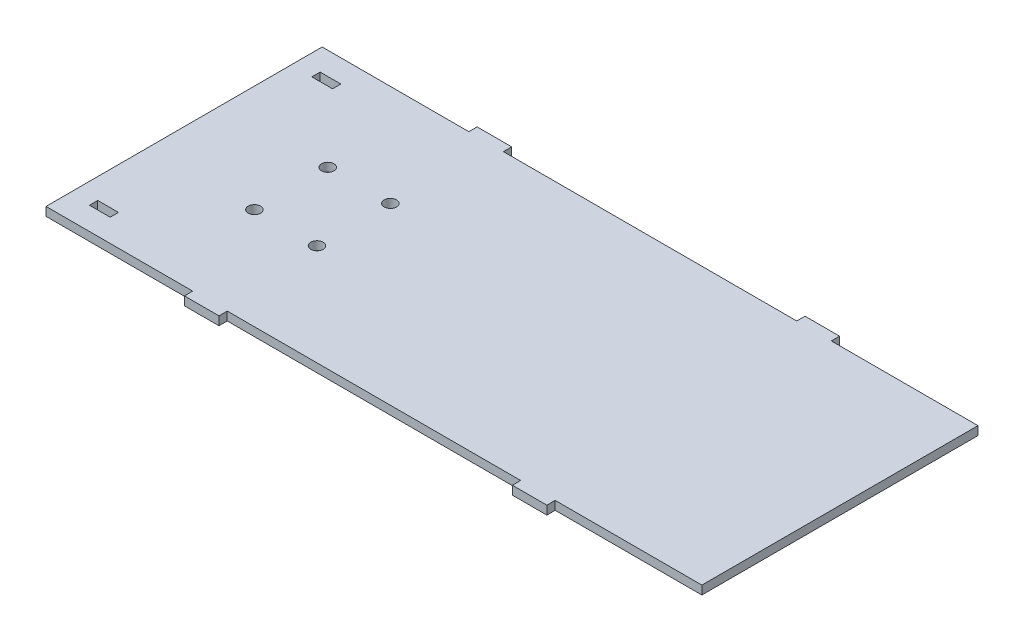
ISO-10303-21;
HEADER;
FILE_DESCRIPTION(('STEP AP214'),'2;1');
FILE_NAME('part.step','',(''),(''),'','','');
FILE_SCHEMA(('AUTOMOTIVE_DESIGN { 1 0 10303 214 1 1 1 1 }'));
ENDSEC;
DATA;
#1=APPLICATION_CONTEXT('core data for automotive mechanical design processes');
#2=APPLICATION_PROTOCOL_DEFINITION('international standard','automotive_design',2000,#1);
#3=PRODUCT_CONTEXT('',#1,'mechanical');
#4=PRODUCT('Part','Part','',(#3));
#5=PRODUCT_RELATED_PRODUCT_CATEGORY('part','',(#4));
#6=PRODUCT_DEFINITION_FORMATION('','',#4);
#7=PRODUCT_DEFINITION_CONTEXT('part definition',#1,'design');
#8=PRODUCT_DEFINITION('design','',#6,#7);
#9=PRODUCT_DEFINITION_SHAPE('','',#8);
#10=(LENGTH_UNIT() NAMED_UNIT(*) SI_UNIT(.MILLI.,.METRE.));
#11=(NAMED_UNIT(*) PLANE_ANGLE_UNIT() SI_UNIT($,.RADIAN.));
#12=(NAMED_UNIT(*) SI_UNIT($,.STERADIAN.) SOLID_ANGLE_UNIT());
#13=UNCERTAINTY_MEASURE_WITH_UNIT(LENGTH_MEASURE(1.E-05),#10,'distance_accuracy_value','');
#14=(GEOMETRIC_REPRESENTATION_CONTEXT(3) GLOBAL_UNCERTAINTY_ASSIGNED_CONTEXT((#13)) GLOBAL_UNIT_ASSIGNED_CONTEXT((#10,
#11,#12)) REPRESENTATION_CONTEXT('',''));
#15=CARTESIAN_POINT('',(0.,0.,0.));
#16=DIRECTION('',(0.,0.,1.));
#17=DIRECTION('',(1.,0.,0.));
#18=AXIS2_PLACEMENT_3D('',#15,#16,#17);
#19=CARTESIAN_POINT('',(0.,3.175,0.));
#20=DIRECTION('',(0.,0.,-1.));
#21=DIRECTION('',(-1.,0.,0.));
#22=AXIS2_PLACEMENT_3D('',#19,#20,#21);
#23=PLANE('',#22);
#24=DIRECTION('',(1.,0.,0.));
#25=VECTOR('',#24,1.);
#26=CARTESIAN_POINT('',(0.,0.,0.));
#27=LINE('',#26,#25);
#28=CARTESIAN_POINT('',(-12.7,0.,0.));
#29=VERTEX_POINT('',#28);
#30=CARTESIAN_POINT('',(41.2749999999999,0.,0.));
#31=VERTEX_POINT('',#30);
#32=EDGE_CURVE('E346',#29,#31,#27,.T.);
#33=ORIENTED_EDGE('',*,*,#32,.T.);
#34=DIRECTION('',(0.,-1.,0.));
#35=VECTOR('',#34,1.);
#36=CARTESIAN_POINT('',(41.2749999999999,3.175,0.));
#37=LINE('',#36,#35);
#38=CARTESIAN_POINT('',(41.2749999999999,3.175,0.));
#39=VERTEX_POINT('',#38);
#40=EDGE_CURVE('E11',#39,#31,#37,.T.);
#41=ORIENTED_EDGE('',*,*,#40,.F.);
#42=DIRECTION('',(1.,0.,0.));
#43=VECTOR('',#42,1.);
#44=CARTESIAN_POINT('',(0.,3.175,0.));
#45=LINE('',#44,#43);
#46=CARTESIAN_POINT('',(-12.7,3.175,0.));
#47=VERTEX_POINT('',#46);
#48=EDGE_CURVE('E350',#47,#39,#45,.T.);
#49=ORIENTED_EDGE('',*,*,#48,.F.);
#50=DIRECTION('',(0.,-1.,0.));
#51=VECTOR('',#50,1.);
#52=CARTESIAN_POINT('',(-12.7,3.175,0.));
#53=LINE('',#52,#51);
#54=EDGE_CURVE('E411',#47,#29,#53,.T.);
#55=ORIENTED_EDGE('',*,*,#54,.T.);
#56=EDGE_LOOP('',(#33,#41,#49,#55));
#57=FACE_BOUND('',#56,.T.);
#58=ADVANCED_FACE('F39',(#57),#23,.F.);
#59=CARTESIAN_POINT('',(41.2749999999999,3.175,0.));
#60=DIRECTION('',(1.,0.,0.));
#61=DIRECTION('',(0.,0.,-1.));
#62=AXIS2_PLACEMENT_3D('',#59,#60,#61);
#63=PLANE('',#62);
#64=DIRECTION('',(0.,0.,1.));
#65=VECTOR('',#64,1.);
#66=CARTESIAN_POINT('',(41.2749999999999,0.,0.));
#67=LINE('',#66,#65);
#68=CARTESIAN_POINT('',(41.2749999999999,0.,3.04799999999991));
#69=VERTEX_POINT('',#68);
#70=EDGE_CURVE('E414',#31,#69,#67,.T.);
#71=ORIENTED_EDGE('',*,*,#70,.T.);
#72=DIRECTION('',(0.,-1.,0.));
#73=VECTOR('',#72,1.);
#74=CARTESIAN_POINT('',(41.2749999999999,3.175,3.04799999999991));
#75=LINE('',#74,#73);
#76=CARTESIAN_POINT('',(41.2749999999999,3.175,3.04799999999991));
#77=VERTEX_POINT('',#76);
#78=EDGE_CURVE('E47',#77,#69,#75,.T.);
#79=ORIENTED_EDGE('',*,*,#78,.F.);
#80=DIRECTION('',(0.,0.,1.));
#81=VECTOR('',#80,1.);
#82=CARTESIAN_POINT('',(41.2749999999999,3.175,0.));
#83=LINE('',#82,#81);
#84=EDGE_CURVE('E353',#39,#77,#83,.T.);
#85=ORIENTED_EDGE('',*,*,#84,.F.);
#86=ORIENTED_EDGE('',*,*,#40,.T.);
#87=EDGE_LOOP('',(#71,#79,#85,#86));
#88=FACE_BOUND('',#87,.T.);
#89=ADVANCED_FACE('F571',(#88),#63,.F.);
#90=CARTESIAN_POINT('',(53.975,3.175,3.04799999999991));
#91=DIRECTION('',(0.,0.,-1.));
#92=DIRECTION('',(-1.,0.,0.));
#93=AXIS2_PLACEMENT_3D('',#90,#91,#92);
#94=PLANE('',#93);
#95=DIRECTION('',(1.,0.,0.));
#96=VECTOR('',#95,1.);
#97=CARTESIAN_POINT('',(53.975,0.,3.04799999999991));
#98=LINE('',#97,#96);
#99=CARTESIAN_POINT('',(53.975,0.,3.04799999999991));
#100=VERTEX_POINT('',#99);
#101=EDGE_CURVE('E417',#69,#100,#98,.T.);
#102=ORIENTED_EDGE('',*,*,#101,.T.);
#103=DIRECTION('',(0.,-1.,0.));
#104=VECTOR('',#103,1.);
#105=CARTESIAN_POINT('',(53.975,3.175,3.04799999999991));
#106=LINE('',#105,#104);
#107=CARTESIAN_POINT('',(53.975,3.175,3.04799999999991));
#108=VERTEX_POINT('',#107);
#109=EDGE_CURVE('E539',#108,#100,#106,.T.);
#110=ORIENTED_EDGE('',*,*,#109,.F.);
#111=DIRECTION('',(1.,0.,0.));
#112=VECTOR('',#111,1.);
#113=CARTESIAN_POINT('',(53.975,3.175,3.04799999999991));
#114=LINE('',#113,#112);
#115=EDGE_CURVE('E357',#77,#108,#114,.T.);
#116=ORIENTED_EDGE('',*,*,#115,.F.);
#117=ORIENTED_EDGE('',*,*,#78,.T.);
#118=EDGE_LOOP('',(#102,#110,#116,#117));
#119=FACE_BOUND('',#118,.T.);
#120=ADVANCED_FACE('F548',(#119),#94,.F.);
#121=CARTESIAN_POINT('',(53.9749999999999,3.175,0.));
#122=DIRECTION('',(-1.,0.,0.));
#123=DIRECTION('',(0.,0.,1.));
#124=AXIS2_PLACEMENT_3D('',#121,#122,#123);
#125=PLANE('',#124);
#126=DIRECTION('',(0.,0.,-1.));
#127=VECTOR('',#126,1.);
#128=CARTESIAN_POINT('',(53.9749999999999,0.,0.));
#129=LINE('',#128,#127);
#130=CARTESIAN_POINT('',(53.9749999999999,0.,0.));
#131=VERTEX_POINT('',#130);
#132=EDGE_CURVE('E420',#100,#131,#129,.T.);
#133=ORIENTED_EDGE('',*,*,#132,.T.);
#134=DIRECTION('',(0.,-1.,0.));
#135=VECTOR('',#134,1.);
#136=CARTESIAN_POINT('',(53.9749999999999,3.175,0.));
#137=LINE('',#136,#135);
#138=CARTESIAN_POINT('',(53.9749999999999,3.175,0.));
#139=VERTEX_POINT('',#138);
#140=EDGE_CURVE('E535',#139,#131,#137,.T.);
#141=ORIENTED_EDGE('',*,*,#140,.F.);
#142=DIRECTION('',(0.,0.,-1.));
#143=VECTOR('',#142,1.);
#144=CARTESIAN_POINT('',(53.9749999999999,3.175,0.));
#145=LINE('',#144,#143);
#146=EDGE_CURVE('E360',#108,#139,#145,.T.);
#147=ORIENTED_EDGE('',*,*,#146,.F.);
#148=ORIENTED_EDGE('',*,*,#109,.T.);
#149=EDGE_LOOP('',(#133,#141,#147,#148));
#150=FACE_BOUND('',#149,.T.);
#151=ADVANCED_FACE('F559',(#150),#125,.F.);
#152=CARTESIAN_POINT('',(53.9749999999999,3.175,0.));
#153=DIRECTION('',(0.,0.,-1.));
#154=DIRECTION('',(-1.,0.,0.));
#155=AXIS2_PLACEMENT_3D('',#152,#153,#154);
#156=PLANE('',#155);
#157=DIRECTION('',(1.,0.,0.));
#158=VECTOR('',#157,1.);
#159=CARTESIAN_POINT('',(53.9749999999999,0.,0.));
#160=LINE('',#159,#158);
#161=CARTESIAN_POINT('',(161.925,0.,0.));
#162=VERTEX_POINT('',#161);
#163=EDGE_CURVE('E423',#131,#162,#160,.T.);
#164=ORIENTED_EDGE('',*,*,#163,.T.);
#165=DIRECTION('',(0.,-1.,0.));
#166=VECTOR('',#165,1.);
#167=CARTESIAN_POINT('',(161.925,3.175,0.));
#168=LINE('',#167,#166);
#169=CARTESIAN_POINT('',(161.925,3.175,0.));
#170=VERTEX_POINT('',#169);
#171=EDGE_CURVE('E531',#170,#162,#168,.T.);
#172=ORIENTED_EDGE('',*,*,#171,.F.);
#173=DIRECTION('',(1.,0.,0.));
#174=VECTOR('',#173,1.);
#175=CARTESIAN_POINT('',(53.9749999999999,3.175,0.));
#176=LINE('',#175,#174);
#177=EDGE_CURVE('E363',#139,#170,#176,.T.);
#178=ORIENTED_EDGE('',*,*,#177,.F.);
#179=ORIENTED_EDGE('',*,*,#140,.T.);
#180=EDGE_LOOP('',(#164,#172,#178,#179));
#181=FACE_BOUND('',#180,.T.);
#182=ADVANCED_FACE('F563',(#181),#156,.F.);
#183=CARTESIAN_POINT('',(161.925,3.175,0.));
#184=DIRECTION('',(1.,0.,0.));
#185=DIRECTION('',(0.,0.,-1.));
#186=AXIS2_PLACEMENT_3D('',#183,#184,#185);
#187=PLANE('',#186);
#188=DIRECTION('',(0.,0.,1.));
#189=VECTOR('',#188,1.);
#190=CARTESIAN_POINT('',(161.925,0.,0.));
#191=LINE('',#190,#189);
#192=CARTESIAN_POINT('',(161.925,0.,3.048));
#193=VERTEX_POINT('',#192);
#194=EDGE_CURVE('E426',#162,#193,#191,.T.);
#195=ORIENTED_EDGE('',*,*,#194,.T.);
#196=DIRECTION('',(0.,-1.,0.));
#197=VECTOR('',#196,1.);
#198=CARTESIAN_POINT('',(161.925,3.175,3.048));
#199=LINE('',#198,#197);
#200=CARTESIAN_POINT('',(161.925,3.175,3.048));
#201=VERTEX_POINT('',#200);
#202=EDGE_CURVE('E527',#201,#193,#199,.T.);
#203=ORIENTED_EDGE('',*,*,#202,.F.);
#204=DIRECTION('',(0.,0.,1.));
#205=VECTOR('',#204,1.);
#206=CARTESIAN_POINT('',(161.925,3.175,0.));
#207=LINE('',#206,#205);
#208=EDGE_CURVE('E366',#170,#201,#207,.T.);
#209=ORIENTED_EDGE('',*,*,#208,.F.);
#210=ORIENTED_EDGE('',*,*,#171,.T.);
#211=EDGE_LOOP('',(#195,#203,#209,#210));
#212=FACE_BOUND('',#211,.T.);
#213=ADVANCED_FACE('F643',(#212),#187,.F.);
#214=CARTESIAN_POINT('',(161.925,3.175,3.048));
#215=DIRECTION('',(0.,0.,-1.));
#216=DIRECTION('',(-1.,0.,0.));
#217=AXIS2_PLACEMENT_3D('',#214,#215,#216);
#218=PLANE('',#217);
#219=DIRECTION('',(1.,0.,0.));
#220=VECTOR('',#219,1.);
#221=CARTESIAN_POINT('',(161.925,0.,3.048));
#222=LINE('',#221,#220);
#223=CARTESIAN_POINT('',(174.625,0.,3.048));
#224=VERTEX_POINT('',#223);
#225=EDGE_CURVE('E429',#193,#224,#222,.T.);
#226=ORIENTED_EDGE('',*,*,#225,.T.);
#227=DIRECTION('',(0.,-1.,0.));
#228=VECTOR('',#227,1.);
#229=CARTESIAN_POINT('',(174.625,3.175,3.048));
#230=LINE('',#229,#228);
#231=CARTESIAN_POINT('',(174.625,3.175,3.048));
#232=VERTEX_POINT('',#231);
#233=EDGE_CURVE('E523',#232,#224,#230,.T.);
#234=ORIENTED_EDGE('',*,*,#233,.F.);
#235=DIRECTION('',(1.,0.,0.));
#236=VECTOR('',#235,1.);
#237=CARTESIAN_POINT('',(161.925,3.175,3.048));
#238=LINE('',#237,#236);
#239=EDGE_CURVE('E369',#201,#232,#238,.T.);
#240=ORIENTED_EDGE('',*,*,#239,.F.);
#241=ORIENTED_EDGE('',*,*,#202,.T.);
#242=EDGE_LOOP('',(#226,#234,#240,#241));
#243=FACE_BOUND('',#242,.T.);
#244=ADVANCED_FACE('F640',(#243),#218,.F.);
#245=CARTESIAN_POINT('',(174.625,3.175,0.));
#246=DIRECTION('',(-1.,0.,0.));
#247=DIRECTION('',(0.,0.,1.));
#248=AXIS2_PLACEMENT_3D('',#245,#246,#247);
#249=PLANE('',#248);
#250=DIRECTION('',(0.,0.,-1.));
#251=VECTOR('',#250,1.);
#252=CARTESIAN_POINT('',(174.625,0.,0.));
#253=LINE('',#252,#251);
#254=CARTESIAN_POINT('',(174.625,0.,0.));
#255=VERTEX_POINT('',#254);
#256=EDGE_CURVE('E432',#224,#255,#253,.T.);
#257=ORIENTED_EDGE('',*,*,#256,.T.);
#258=DIRECTION('',(0.,-1.,0.));
#259=VECTOR('',#258,1.);
#260=CARTESIAN_POINT('',(174.625,3.175,0.));
#261=LINE('',#260,#259);
#262=CARTESIAN_POINT('',(174.625,3.175,0.));
#263=VERTEX_POINT('',#262);
#264=EDGE_CURVE('E519',#263,#255,#261,.T.);
#265=ORIENTED_EDGE('',*,*,#264,.F.);
#266=DIRECTION('',(0.,0.,-1.));
#267=VECTOR('',#266,1.);
#268=CARTESIAN_POINT('',(174.625,3.175,0.));
#269=LINE('',#268,#267);
#270=EDGE_CURVE('E372',#232,#263,#269,.T.);
#271=ORIENTED_EDGE('',*,*,#270,.F.);
#272=ORIENTED_EDGE('',*,*,#233,.T.);
#273=EDGE_LOOP('',(#257,#265,#271,#272));
#274=FACE_BOUND('',#273,.T.);
#275=ADVANCED_FACE('F636',(#274),#249,.F.);
#276=CARTESIAN_POINT('',(174.625,3.175,0.));
#277=DIRECTION('',(0.,0.,-1.));
#278=DIRECTION('',(-1.,0.,0.));
#279=AXIS2_PLACEMENT_3D('',#276,#277,#278);
#280=PLANE('',#279);
#281=DIRECTION('',(1.,0.,0.));
#282=VECTOR('',#281,1.);
#283=CARTESIAN_POINT('',(174.625,0.,0.));
#284=LINE('',#283,#282);
#285=CARTESIAN_POINT('',(228.6,0.,0.));
#286=VERTEX_POINT('',#285);
#287=EDGE_CURVE('E435',#255,#286,#284,.T.);
#288=ORIENTED_EDGE('',*,*,#287,.T.);
#289=DIRECTION('',(0.,-1.,0.));
#290=VECTOR('',#289,1.);
#291=CARTESIAN_POINT('',(228.6,3.175,0.));
#292=LINE('',#291,#290);
#293=CARTESIAN_POINT('',(228.6,3.175,0.));
#294=VERTEX_POINT('',#293);
#295=EDGE_CURVE('E515',#294,#286,#292,.T.);
#296=ORIENTED_EDGE('',*,*,#295,.F.);
#297=DIRECTION('',(1.,0.,0.));
#298=VECTOR('',#297,1.);
#299=CARTESIAN_POINT('',(174.625,3.175,0.));
#300=LINE('',#299,#298);
#301=EDGE_CURVE('E375',#263,#294,#300,.T.);
#302=ORIENTED_EDGE('',*,*,#301,.F.);
#303=ORIENTED_EDGE('',*,*,#264,.T.);
#304=EDGE_LOOP('',(#288,#296,#302,#303));
#305=FACE_BOUND('',#304,.T.);
#306=ADVANCED_FACE('F632',(#305),#280,.F.);
#307=CARTESIAN_POINT('',(228.6,3.175,0.));
#308=DIRECTION('',(-1.,0.,0.));
#309=DIRECTION('',(0.,0.,1.));
#310=AXIS2_PLACEMENT_3D('',#307,#308,#309);
#311=PLANE('',#310);
#312=DIRECTION('',(0.,0.,-1.));
#313=VECTOR('',#312,1.);
#314=CARTESIAN_POINT('',(228.6,0.,0.));
#315=LINE('',#314,#313);
#316=CARTESIAN_POINT('',(228.6,0.,-101.6));
#317=VERTEX_POINT('',#316);
#318=EDGE_CURVE('E438',#286,#317,#315,.T.);
#319=ORIENTED_EDGE('',*,*,#318,.T.);
#320=DIRECTION('',(0.,-1.,0.));
#321=VECTOR('',#320,1.);
#322=CARTESIAN_POINT('',(228.6,3.175,-101.6));
#323=LINE('',#322,#321);
#324=CARTESIAN_POINT('',(228.6,3.175,-101.6));
#325=VERTEX_POINT('',#324);
#326=EDGE_CURVE('E511',#325,#317,#323,.T.);
#327=ORIENTED_EDGE('',*,*,#326,.F.);
#328=DIRECTION('',(0.,0.,-1.));
#329=VECTOR('',#328,1.);
#330=CARTESIAN_POINT('',(228.6,3.175,0.));
#331=LINE('',#330,#329);
#332=EDGE_CURVE('E378',#294,#325,#331,.T.);
#333=ORIENTED_EDGE('',*,*,#332,.F.);
#334=ORIENTED_EDGE('',*,*,#295,.T.);
#335=EDGE_LOOP('',(#319,#327,#333,#334));
#336=FACE_BOUND('',#335,.T.);
#337=ADVANCED_FACE('F627',(#336),#311,.F.);
#338=CARTESIAN_POINT('',(174.625,3.175,-101.6));
#339=DIRECTION('',(0.,0.,1.));
#340=DIRECTION('',(1.,0.,0.));
#341=AXIS2_PLACEMENT_3D('',#338,#339,#340);
#342=PLANE('',#341);
#343=DIRECTION('',(-1.,0.,0.));
#344=VECTOR('',#343,1.);
#345=CARTESIAN_POINT('',(174.625,0.,-101.6));
#346=LINE('',#345,#344);
#347=CARTESIAN_POINT('',(174.625,0.,-101.6));
#348=VERTEX_POINT('',#347);
#349=EDGE_CURVE('E441',#317,#348,#346,.T.);
#350=ORIENTED_EDGE('',*,*,#349,.T.);
#351=DIRECTION('',(0.,-1.,0.));
#352=VECTOR('',#351,1.);
#353=CARTESIAN_POINT('',(174.625,3.175,-101.6));
#354=LINE('',#353,#352);
#355=CARTESIAN_POINT('',(174.625,3.175,-101.6));
#356=VERTEX_POINT('',#355);
#357=EDGE_CURVE('E507',#356,#348,#354,.T.);
#358=ORIENTED_EDGE('',*,*,#357,.F.);
#359=DIRECTION('',(-1.,0.,0.));
#360=VECTOR('',#359,1.);
#361=CARTESIAN_POINT('',(174.625,3.175,-101.6));
#362=LINE('',#361,#360);
#363=EDGE_CURVE('E381',#325,#356,#362,.T.);
#364=ORIENTED_EDGE('',*,*,#363,.F.);
#365=ORIENTED_EDGE('',*,*,#326,.T.);
#366=EDGE_LOOP('',(#350,#358,#364,#365));
#367=FACE_BOUND('',#366,.T.);
#368=ADVANCED_FACE('F621',(#367),#342,.F.);
#369=CARTESIAN_POINT('',(174.625,3.175,-101.6));
#370=DIRECTION('',(-1.,0.,0.));
#371=DIRECTION('',(0.,0.,1.));
#372=AXIS2_PLACEMENT_3D('',#369,#370,#371);
#373=PLANE('',#372);
#374=DIRECTION('',(0.,0.,-1.));
#375=VECTOR('',#374,1.);
#376=CARTESIAN_POINT('',(174.625,0.,-101.6));
#377=LINE('',#376,#375);
#378=CARTESIAN_POINT('',(174.625,0.,-104.648));
#379=VERTEX_POINT('',#378);
#380=EDGE_CURVE('E444',#348,#379,#377,.T.);
#381=ORIENTED_EDGE('',*,*,#380,.T.);
#382=DIRECTION('',(0.,-1.,0.));
#383=VECTOR('',#382,1.);
#384=CARTESIAN_POINT('',(174.625,3.175,-104.648));
#385=LINE('',#384,#383);
#386=CARTESIAN_POINT('',(174.625,3.175,-104.648));
#387=VERTEX_POINT('',#386);
#388=EDGE_CURVE('E503',#387,#379,#385,.T.);
#389=ORIENTED_EDGE('',*,*,#388,.F.);
#390=DIRECTION('',(0.,0.,-1.));
#391=VECTOR('',#390,1.);
#392=CARTESIAN_POINT('',(174.625,3.175,-101.6));
#393=LINE('',#392,#391);
#394=EDGE_CURVE('E384',#356,#387,#393,.T.);
#395=ORIENTED_EDGE('',*,*,#394,.F.);
#396=ORIENTED_EDGE('',*,*,#357,.T.);
#397=EDGE_LOOP('',(#381,#389,#395,#396));
#398=FACE_BOUND('',#397,.T.);
#399=ADVANCED_FACE('F617',(#398),#373,.F.);
#400=CARTESIAN_POINT('',(161.925,3.175,-104.648));
#401=DIRECTION('',(0.,0.,1.));
#402=DIRECTION('',(1.,0.,0.));
#403=AXIS2_PLACEMENT_3D('',#400,#401,#402);
#404=PLANE('',#403);
#405=DIRECTION('',(-1.,0.,0.));
#406=VECTOR('',#405,1.);
#407=CARTESIAN_POINT('',(161.925,0.,-104.648));
#408=LINE('',#407,#406);
#409=CARTESIAN_POINT('',(161.925,0.,-104.648));
#410=VERTEX_POINT('',#409);
#411=EDGE_CURVE('E447',#379,#410,#408,.T.);
#412=ORIENTED_EDGE('',*,*,#411,.T.);
#413=DIRECTION('',(0.,-1.,0.));
#414=VECTOR('',#413,1.);
#415=CARTESIAN_POINT('',(161.925,3.175,-104.648));
#416=LINE('',#415,#414);
#417=CARTESIAN_POINT('',(161.925,3.175,-104.648));
#418=VERTEX_POINT('',#417);
#419=EDGE_CURVE('E499',#418,#410,#416,.T.);
#420=ORIENTED_EDGE('',*,*,#419,.F.);
#421=DIRECTION('',(-1.,0.,0.));
#422=VECTOR('',#421,1.);
#423=CARTESIAN_POINT('',(161.925,3.175,-104.648));
#424=LINE('',#423,#422);
#425=EDGE_CURVE('E387',#387,#418,#424,.T.);
#426=ORIENTED_EDGE('',*,*,#425,.F.);
#427=ORIENTED_EDGE('',*,*,#388,.T.);
#428=EDGE_LOOP('',(#412,#420,#426,#427));
#429=FACE_BOUND('',#428,.T.);
#430=ADVANCED_FACE('F612',(#429),#404,.F.);
#431=CARTESIAN_POINT('',(161.925,3.175,-101.6));
#432=DIRECTION('',(1.,0.,0.));
#433=DIRECTION('',(0.,0.,-1.));
#434=AXIS2_PLACEMENT_3D('',#431,#432,#433);
#435=PLANE('',#434);
#436=DIRECTION('',(0.,0.,1.));
#437=VECTOR('',#436,1.);
#438=CARTESIAN_POINT('',(161.925,0.,-101.6));
#439=LINE('',#438,#437);
#440=CARTESIAN_POINT('',(161.925,0.,-101.6));
#441=VERTEX_POINT('',#440);
#442=EDGE_CURVE('E450',#410,#441,#439,.T.);
#443=ORIENTED_EDGE('',*,*,#442,.T.);
#444=DIRECTION('',(0.,-1.,0.));
#445=VECTOR('',#444,1.);
#446=CARTESIAN_POINT('',(161.925,3.175,-101.6));
#447=LINE('',#446,#445);
#448=CARTESIAN_POINT('',(161.925,3.175,-101.6));
#449=VERTEX_POINT('',#448);
#450=EDGE_CURVE('E495',#449,#441,#447,.T.);
#451=ORIENTED_EDGE('',*,*,#450,.F.);
#452=DIRECTION('',(0.,0.,1.));
#453=VECTOR('',#452,1.);
#454=CARTESIAN_POINT('',(161.925,3.175,-101.6));
#455=LINE('',#454,#453);
#456=EDGE_CURVE('E390',#418,#449,#455,.T.);
#457=ORIENTED_EDGE('',*,*,#456,.F.);
#458=ORIENTED_EDGE('',*,*,#419,.T.);
#459=EDGE_LOOP('',(#443,#451,#457,#458));
#460=FACE_BOUND('',#459,.T.);
#461=ADVANCED_FACE('F606',(#460),#435,.F.);
#462=CARTESIAN_POINT('',(53.975,3.175,-101.6));
#463=DIRECTION('',(0.,0.,1.));
#464=DIRECTION('',(1.,0.,0.));
#465=AXIS2_PLACEMENT_3D('',#462,#463,#464);
#466=PLANE('',#465);
#467=DIRECTION('',(-1.,0.,0.));
#468=VECTOR('',#467,1.);
#469=CARTESIAN_POINT('',(53.975,0.,-101.6));
#470=LINE('',#469,#468);
#471=CARTESIAN_POINT('',(53.975,0.,-101.6));
#472=VERTEX_POINT('',#471);
#473=EDGE_CURVE('E453',#441,#472,#470,.T.);
#474=ORIENTED_EDGE('',*,*,#473,.T.);
#475=DIRECTION('',(0.,-1.,0.));
#476=VECTOR('',#475,1.);
#477=CARTESIAN_POINT('',(53.975,3.175,-101.6));
#478=LINE('',#477,#476);
#479=CARTESIAN_POINT('',(53.975,3.175,-101.6));
#480=VERTEX_POINT('',#479);
#481=EDGE_CURVE('E491',#480,#472,#478,.T.);
#482=ORIENTED_EDGE('',*,*,#481,.F.);
#483=DIRECTION('',(-1.,0.,0.));
#484=VECTOR('',#483,1.);
#485=CARTESIAN_POINT('',(53.975,3.175,-101.6));
#486=LINE('',#485,#484);
#487=EDGE_CURVE('E393',#449,#480,#486,.T.);
#488=ORIENTED_EDGE('',*,*,#487,.F.);
#489=ORIENTED_EDGE('',*,*,#450,.T.);
#490=EDGE_LOOP('',(#474,#482,#488,#489));
#491=FACE_BOUND('',#490,.T.);
#492=ADVANCED_FACE('F602',(#491),#466,.F.);
#493=CARTESIAN_POINT('',(53.975,3.175,-101.6));
#494=DIRECTION('',(-1.,0.,0.));
#495=DIRECTION('',(0.,0.,1.));
#496=AXIS2_PLACEMENT_3D('',#493,#494,#495);
#497=PLANE('',#496);
#498=DIRECTION('',(0.,0.,-1.));
#499=VECTOR('',#498,1.);
#500=CARTESIAN_POINT('',(53.975,0.,-101.6));
#501=LINE('',#500,#499);
#502=CARTESIAN_POINT('',(53.975,0.,-104.648));
#503=VERTEX_POINT('',#502);
#504=EDGE_CURVE('E456',#472,#503,#501,.T.);
#505=ORIENTED_EDGE('',*,*,#504,.T.);
#506=DIRECTION('',(0.,-1.,0.));
#507=VECTOR('',#506,1.);
#508=CARTESIAN_POINT('',(53.975,3.175,-104.648));
#509=LINE('',#508,#507);
#510=CARTESIAN_POINT('',(53.975,3.175,-104.648));
#511=VERTEX_POINT('',#510);
#512=EDGE_CURVE('E487',#511,#503,#509,.T.);
#513=ORIENTED_EDGE('',*,*,#512,.F.);
#514=DIRECTION('',(0.,0.,-1.));
#515=VECTOR('',#514,1.);
#516=CARTESIAN_POINT('',(53.975,3.175,-101.6));
#517=LINE('',#516,#515);
#518=EDGE_CURVE('E396',#480,#511,#517,.T.);
#519=ORIENTED_EDGE('',*,*,#518,.F.);
#520=ORIENTED_EDGE('',*,*,#481,.T.);
#521=EDGE_LOOP('',(#505,#513,#519,#520));
#522=FACE_BOUND('',#521,.T.);
#523=ADVANCED_FACE('F597',(#522),#497,.F.);
#524=CARTESIAN_POINT('',(53.975,3.175,-104.648));
#525=DIRECTION('',(0.,0.,1.));
#526=DIRECTION('',(1.,0.,0.));
#527=AXIS2_PLACEMENT_3D('',#524,#525,#526);
#528=PLANE('',#527);
#529=DIRECTION('',(-1.,0.,0.));
#530=VECTOR('',#529,1.);
#531=CARTESIAN_POINT('',(53.975,0.,-104.648));
#532=LINE('',#531,#530);
#533=CARTESIAN_POINT('',(41.2749999999999,0.,-104.648));
#534=VERTEX_POINT('',#533);
#535=EDGE_CURVE('E459',#503,#534,#532,.T.);
#536=ORIENTED_EDGE('',*,*,#535,.T.);
#537=DIRECTION('',(0.,-1.,0.));
#538=VECTOR('',#537,1.);
#539=CARTESIAN_POINT('',(41.2749999999999,3.175,-104.648));
#540=LINE('',#539,#538);
#541=CARTESIAN_POINT('',(41.2749999999999,3.175,-104.648));
#542=VERTEX_POINT('',#541);
#543=EDGE_CURVE('E483',#542,#534,#540,.T.);
#544=ORIENTED_EDGE('',*,*,#543,.F.);
#545=DIRECTION('',(-1.,0.,0.));
#546=VECTOR('',#545,1.);
#547=CARTESIAN_POINT('',(53.975,3.175,-104.648));
#548=LINE('',#547,#546);
#549=EDGE_CURVE('E399',#511,#542,#548,.T.);
#550=ORIENTED_EDGE('',*,*,#549,.F.);
#551=ORIENTED_EDGE('',*,*,#512,.T.);
#552=EDGE_LOOP('',(#536,#544,#550,#551));
#553=FACE_BOUND('',#552,.T.);
#554=ADVANCED_FACE('F591',(#553),#528,.F.);
#555=CARTESIAN_POINT('',(41.275,3.175,-101.6));
#556=DIRECTION('',(1.,0.,0.));
#557=DIRECTION('',(0.,0.,-1.));
#558=AXIS2_PLACEMENT_3D('',#555,#556,#557);
#559=PLANE('',#558);
#560=DIRECTION('',(0.,0.,1.));
#561=VECTOR('',#560,1.);
#562=CARTESIAN_POINT('',(41.275,0.,-101.6));
#563=LINE('',#562,#561);
#564=CARTESIAN_POINT('',(41.275,0.,-101.6));
#565=VERTEX_POINT('',#564);
#566=EDGE_CURVE('E462',#534,#565,#563,.T.);
#567=ORIENTED_EDGE('',*,*,#566,.T.);
#568=DIRECTION('',(0.,-1.,0.));
#569=VECTOR('',#568,1.);
#570=CARTESIAN_POINT('',(41.275,3.175,-101.6));
#571=LINE('',#570,#569);
#572=CARTESIAN_POINT('',(41.275,3.175,-101.6));
#573=VERTEX_POINT('',#572);
#574=EDGE_CURVE('E479',#573,#565,#571,.T.);
#575=ORIENTED_EDGE('',*,*,#574,.F.);
#576=DIRECTION('',(0.,0.,1.));
#577=VECTOR('',#576,1.);
#578=CARTESIAN_POINT('',(41.275,3.175,-101.6));
#579=LINE('',#578,#577);
#580=EDGE_CURVE('E402',#542,#573,#579,.T.);
#581=ORIENTED_EDGE('',*,*,#580,.F.);
#582=ORIENTED_EDGE('',*,*,#543,.T.);
#583=EDGE_LOOP('',(#567,#575,#581,#582));
#584=FACE_BOUND('',#583,.T.);
#585=ADVANCED_FACE('F586',(#584),#559,.F.);
#586=CARTESIAN_POINT('',(0.,3.175,-101.6));
#587=DIRECTION('',(0.,0.,1.));
#588=DIRECTION('',(1.,0.,0.));
#589=AXIS2_PLACEMENT_3D('',#586,#587,#588);
#590=PLANE('',#589);
#591=DIRECTION('',(-1.,0.,0.));
#592=VECTOR('',#591,1.);
#593=CARTESIAN_POINT('',(0.,0.,-101.6));
#594=LINE('',#593,#592);
#595=CARTESIAN_POINT('',(-12.7,0.,-101.6));
#596=VERTEX_POINT('',#595);
#597=EDGE_CURVE('E466',#565,#596,#594,.T.);
#598=ORIENTED_EDGE('',*,*,#597,.T.);
#599=DIRECTION('',(0.,-1.,0.));
#600=VECTOR('',#599,1.);
#601=CARTESIAN_POINT('',(-12.7,3.175,-101.6));
#602=LINE('',#601,#600);
#603=CARTESIAN_POINT('',(-12.7,3.175,-101.6));
#604=VERTEX_POINT('',#603);
#605=EDGE_CURVE('E475',#604,#596,#602,.T.);
#606=ORIENTED_EDGE('',*,*,#605,.F.);
#607=DIRECTION('',(-1.,0.,0.));
#608=VECTOR('',#607,1.);
#609=CARTESIAN_POINT('',(0.,3.175,-101.6));
#610=LINE('',#609,#608);
#611=EDGE_CURVE('E405',#573,#604,#610,.T.);
#612=ORIENTED_EDGE('',*,*,#611,.F.);
#613=ORIENTED_EDGE('',*,*,#574,.T.);
#614=EDGE_LOOP('',(#598,#606,#612,#613));
#615=FACE_BOUND('',#614,.T.);
#616=ADVANCED_FACE('F581',(#615),#590,.F.);
#617=CARTESIAN_POINT('',(-12.7,3.175,0.));
#618=DIRECTION('',(1.,0.,0.));
#619=DIRECTION('',(0.,0.,-1.));
#620=AXIS2_PLACEMENT_3D('',#617,#618,#619);
#621=PLANE('',#620);
#622=DIRECTION('',(0.,0.,1.));
#623=VECTOR('',#622,1.);
#624=CARTESIAN_POINT('',(-12.7,0.,0.));
#625=LINE('',#624,#623);
#626=EDGE_CURVE('E354',#596,#29,#625,.T.);
#627=ORIENTED_EDGE('',*,*,#626,.T.);
#628=ORIENTED_EDGE('',*,*,#54,.F.);
#629=DIRECTION('',(0.,0.,1.));
#630=VECTOR('',#629,1.);
#631=CARTESIAN_POINT('',(-12.7,3.175,0.));
#632=LINE('',#631,#630);
#633=EDGE_CURVE('E408',#604,#47,#632,.T.);
#634=ORIENTED_EDGE('',*,*,#633,.F.);
#635=ORIENTED_EDGE('',*,*,#605,.T.);
#636=EDGE_LOOP('',(#627,#628,#634,#635));
#637=FACE_BOUND('',#636,.T.);
#638=ADVANCED_FACE('F576',(#637),#621,.F.);
#639=CARTESIAN_POINT('',(0.,3.175,0.));
#640=DIRECTION('',(0.,-1.,0.));
#641=DIRECTION('',(0.,0.,-1.));
#642=AXIS2_PLACEMENT_3D('',#639,#640,#641);
#643=PLANE('',#642);
#644=DIRECTION('',(1.,0.,0.));
#645=VECTOR('',#644,1.);
#646=CARTESIAN_POINT('',(-5.08,3.175,-90.1838820353417));
#647=LINE('',#646,#645);
#648=CARTESIAN_POINT('',(-5.08,3.175,-90.1838820353417));
#649=VERTEX_POINT('',#648);
#650=CARTESIAN_POINT('',(2.54,3.175,-90.1838820353417));
#651=VERTEX_POINT('',#650);
#652=EDGE_CURVE('E261',#649,#651,#647,.T.);
#653=ORIENTED_EDGE('',*,*,#652,.F.);
#654=DIRECTION('',(0.,0.,1.));
#655=VECTOR('',#654,1.);
#656=CARTESIAN_POINT('',(-5.08,3.175,-93.2318820353417));
#657=LINE('',#656,#655);
#658=CARTESIAN_POINT('',(-5.08,3.175,-93.2318820353417));
#659=VERTEX_POINT('',#658);
#660=EDGE_CURVE('E54',#659,#649,#657,.T.);
#661=ORIENTED_EDGE('',*,*,#660,.F.);
#662=DIRECTION('',(-1.,0.,0.));
#663=VECTOR('',#662,1.);
#664=CARTESIAN_POINT('',(-5.08,3.175,-93.2318820353417));
#665=LINE('',#664,#663);
#666=CARTESIAN_POINT('',(2.54,3.175,-93.2318820353417));
#667=VERTEX_POINT('',#666);
#668=EDGE_CURVE('E248',#667,#659,#665,.T.);
#669=ORIENTED_EDGE('',*,*,#668,.F.);
#670=DIRECTION('',(0.,0.,-1.));
#671=VECTOR('',#670,1.);
#672=CARTESIAN_POINT('',(2.54,3.175,-93.2318820353417));
#673=LINE('',#672,#671);
#674=EDGE_CURVE('E252',#651,#667,#673,.T.);
#675=ORIENTED_EDGE('',*,*,#674,.F.);
#676=EDGE_LOOP('',(#653,#661,#669,#675));
#677=FACE_BOUND('',#676,.T.);
#678=DIRECTION('',(0.,0.,-1.));
#679=VECTOR('',#678,1.);
#680=CARTESIAN_POINT('',(2.54,3.175,-8.36811796465832));
#681=LINE('',#680,#679);
#682=CARTESIAN_POINT('',(2.54,3.175,-8.36811796465832));
#683=VERTEX_POINT('',#682);
#684=CARTESIAN_POINT('',(2.54,3.175,-11.4161179646583));
#685=VERTEX_POINT('',#684);
#686=EDGE_CURVE('E297',#683,#685,#681,.T.);
#687=ORIENTED_EDGE('',*,*,#686,.F.);
#688=DIRECTION('',(1.,0.,0.));
#689=VECTOR('',#688,1.);
#690=CARTESIAN_POINT('',(-5.08,3.175,-8.36811796465832));
#691=LINE('',#690,#689);
#692=CARTESIAN_POINT('',(-5.08,3.175,-8.36811796465832));
#693=VERTEX_POINT('',#692);
#694=EDGE_CURVE('E62',#693,#683,#691,.T.);
#695=ORIENTED_EDGE('',*,*,#694,.F.);
#696=DIRECTION('',(0.,0.,1.));
#697=VECTOR('',#696,1.);
#698=CARTESIAN_POINT('',(-5.08,3.175,-8.36811796465832));
#699=LINE('',#698,#697);
#700=CARTESIAN_POINT('',(-5.08,3.175,-11.4161179646583));
#701=VERTEX_POINT('',#700);
#702=EDGE_CURVE('E282',#701,#693,#699,.T.);
#703=ORIENTED_EDGE('',*,*,#702,.F.);
#704=DIRECTION('',(-1.,0.,0.));
#705=VECTOR('',#704,1.);
#706=CARTESIAN_POINT('',(-5.08,3.175,-11.4161179646583));
#707=LINE('',#706,#705);
#708=EDGE_CURVE('E301',#685,#701,#707,.T.);
#709=ORIENTED_EDGE('',*,*,#708,.F.);
#710=EDGE_LOOP('',(#687,#695,#703,#709));
#711=FACE_BOUND('',#710,.T.);
#712=CARTESIAN_POINT('',(26.67,3.175,-37.30625));
#713=DIRECTION('',(0.,1.,0.));
#714=DIRECTION('',(0.,0.,-1.));
#715=AXIS2_PLACEMENT_3D('',#712,#713,#714);
#716=CIRCLE('',#715,2.27696952247639);
#717=CARTESIAN_POINT('',(26.67,3.175,-39.5832195224764));
#718=VERTEX_POINT('',#717);
#719=EDGE_CURVE('E271',#718,#718,#716,.T.);
#720=ORIENTED_EDGE('',*,*,#719,.F.);
#721=EDGE_LOOP('',(#720));
#722=FACE_BOUND('',#721,.T.);
#723=CARTESIAN_POINT('',(49.68875,3.175,-37.30625));
#724=DIRECTION('',(0.,1.,0.));
#725=DIRECTION('',(0.,0.,-1.));
#726=AXIS2_PLACEMENT_3D('',#723,#724,#725);
#727=CIRCLE('',#726,2.27696952247639);
#728=CARTESIAN_POINT('',(49.68875,3.175,-39.5832195224764));
#729=VERTEX_POINT('',#728);
#730=EDGE_CURVE('E331',#729,#729,#727,.T.);
#731=ORIENTED_EDGE('',*,*,#730,.F.);
#732=EDGE_LOOP('',(#731));
#733=FACE_BOUND('',#732,.T.);
#734=CARTESIAN_POINT('',(49.68875,3.175,-64.29375));
#735=DIRECTION('',(0.,1.,0.));
#736=DIRECTION('',(0.,0.,1.));
#737=AXIS2_PLACEMENT_3D('',#734,#735,#736);
#738=CIRCLE('',#737,2.27696952247639);
#739=CARTESIAN_POINT('',(49.68875,3.175,-62.0167804775236));
#740=VERTEX_POINT('',#739);
#741=EDGE_CURVE('E323',#740,#740,#738,.T.);
#742=ORIENTED_EDGE('',*,*,#741,.F.);
#743=EDGE_LOOP('',(#742));
#744=FACE_BOUND('',#743,.T.);
#745=CARTESIAN_POINT('',(26.67,3.175,-64.29375));
#746=DIRECTION('',(0.,1.,0.));
#747=DIRECTION('',(0.,0.,1.));
#748=AXIS2_PLACEMENT_3D('',#745,#746,#747);
#749=CIRCLE('',#748,2.27696952247639);
#750=CARTESIAN_POINT('',(26.67,3.175,-62.0167804775236));
#751=VERTEX_POINT('',#750);
#752=EDGE_CURVE('E322',#751,#751,#749,.T.);
#753=ORIENTED_EDGE('',*,*,#752,.F.);
#754=EDGE_LOOP('',(#753));
#755=FACE_BOUND('',#754,.T.);
#756=ORIENTED_EDGE('',*,*,#48,.T.);
#757=ORIENTED_EDGE('',*,*,#84,.T.);
#758=ORIENTED_EDGE('',*,*,#115,.T.);
#759=ORIENTED_EDGE('',*,*,#146,.T.);
#760=ORIENTED_EDGE('',*,*,#177,.T.);
#761=ORIENTED_EDGE('',*,*,#208,.T.);
#762=ORIENTED_EDGE('',*,*,#239,.T.);
#763=ORIENTED_EDGE('',*,*,#270,.T.);
#764=ORIENTED_EDGE('',*,*,#301,.T.);
#765=ORIENTED_EDGE('',*,*,#332,.T.);
#766=ORIENTED_EDGE('',*,*,#363,.T.);
#767=ORIENTED_EDGE('',*,*,#394,.T.);
#768=ORIENTED_EDGE('',*,*,#425,.T.);
#769=ORIENTED_EDGE('',*,*,#456,.T.);
#770=ORIENTED_EDGE('',*,*,#487,.T.);
#771=ORIENTED_EDGE('',*,*,#518,.T.);
#772=ORIENTED_EDGE('',*,*,#549,.T.);
#773=ORIENTED_EDGE('',*,*,#580,.T.);
#774=ORIENTED_EDGE('',*,*,#611,.T.);
#775=ORIENTED_EDGE('',*,*,#633,.T.);
#776=EDGE_LOOP('',(#756,#757,#758,#759,#760,#761,#762,#763,#764,#765,#766,#767,#768,#769,#770,
#771,#772,#773,#774,#775));
#777=FACE_BOUND('',#776,.T.);
#778=ADVANCED_FACE('F567',(#677,#711,#722,#733,#744,#755,#777),#643,.F.);
#779=CARTESIAN_POINT('',(0.,0.,0.));
#780=DIRECTION('',(0.,-1.,0.));
#781=DIRECTION('',(0.,0.,-1.));
#782=AXIS2_PLACEMENT_3D('',#779,#780,#781);
#783=PLANE('',#782);
#784=DIRECTION('',(0.,0.,1.));
#785=VECTOR('',#784,1.);
#786=CARTESIAN_POINT('',(-5.08,0.,-93.2318820353417));
#787=LINE('',#786,#785);
#788=CARTESIAN_POINT('',(-5.08,0.,-93.2318820353417));
#789=VERTEX_POINT('',#788);
#790=CARTESIAN_POINT('',(-5.08,0.,-90.1838820353417));
#791=VERTEX_POINT('',#790);
#792=EDGE_CURVE('E226',#789,#791,#787,.T.);
#793=ORIENTED_EDGE('',*,*,#792,.T.);
#794=DIRECTION('',(1.,0.,0.));
#795=VECTOR('',#794,1.);
#796=CARTESIAN_POINT('',(-5.08,0.,-90.1838820353417));
#797=LINE('',#796,#795);
#798=CARTESIAN_POINT('',(2.54,0.,-90.1838820353417));
#799=VERTEX_POINT('',#798);
#800=EDGE_CURVE('E237',#791,#799,#797,.T.);
#801=ORIENTED_EDGE('',*,*,#800,.T.);
#802=DIRECTION('',(0.,0.,-1.));
#803=VECTOR('',#802,1.);
#804=CARTESIAN_POINT('',(2.54,0.,-93.2318820353417));
#805=LINE('',#804,#803);
#806=CARTESIAN_POINT('',(2.54,0.,-93.2318820353417));
#807=VERTEX_POINT('',#806);
#808=EDGE_CURVE('E242',#799,#807,#805,.T.);
#809=ORIENTED_EDGE('',*,*,#808,.T.);
#810=DIRECTION('',(-1.,0.,0.));
#811=VECTOR('',#810,1.);
#812=CARTESIAN_POINT('',(-5.08,0.,-93.2318820353417));
#813=LINE('',#812,#811);
#814=EDGE_CURVE('E233',#807,#789,#813,.T.);
#815=ORIENTED_EDGE('',*,*,#814,.T.);
#816=EDGE_LOOP('',(#793,#801,#809,#815));
#817=FACE_BOUND('',#816,.T.);
#818=DIRECTION('',(1.,0.,0.));
#819=VECTOR('',#818,1.);
#820=CARTESIAN_POINT('',(-5.08,0.,-8.36811796465832));
#821=LINE('',#820,#819);
#822=CARTESIAN_POINT('',(-5.08,0.,-8.36811796465832));
#823=VERTEX_POINT('',#822);
#824=CARTESIAN_POINT('',(2.54,0.,-8.36811796465832));
#825=VERTEX_POINT('',#824);
#826=EDGE_CURVE('E277',#823,#825,#821,.T.);
#827=ORIENTED_EDGE('',*,*,#826,.T.);
#828=DIRECTION('',(0.,0.,-1.));
#829=VECTOR('',#828,1.);
#830=CARTESIAN_POINT('',(2.54,0.,-8.36811796465832));
#831=LINE('',#830,#829);
#832=CARTESIAN_POINT('',(2.54,0.,-11.4161179646583));
#833=VERTEX_POINT('',#832);
#834=EDGE_CURVE('E281',#825,#833,#831,.T.);
#835=ORIENTED_EDGE('',*,*,#834,.T.);
#836=DIRECTION('',(-1.,0.,0.));
#837=VECTOR('',#836,1.);
#838=CARTESIAN_POINT('',(-5.08,0.,-11.4161179646583));
#839=LINE('',#838,#837);
#840=CARTESIAN_POINT('',(-5.08,0.,-11.4161179646583));
#841=VERTEX_POINT('',#840);
#842=EDGE_CURVE('E286',#833,#841,#839,.T.);
#843=ORIENTED_EDGE('',*,*,#842,.T.);
#844=DIRECTION('',(0.,0.,1.));
#845=VECTOR('',#844,1.);
#846=CARTESIAN_POINT('',(-5.08,0.,-8.36811796465832));
#847=LINE('',#846,#845);
#848=EDGE_CURVE('E290',#841,#823,#847,.T.);
#849=ORIENTED_EDGE('',*,*,#848,.T.);
#850=EDGE_LOOP('',(#827,#835,#843,#849));
#851=FACE_BOUND('',#850,.T.);
#852=CARTESIAN_POINT('',(26.67,0.,-37.30625));
#853=DIRECTION('',(0.,1.,0.));
#854=DIRECTION('',(0.,0.,-1.));
#855=AXIS2_PLACEMENT_3D('',#852,#853,#854);
#856=CIRCLE('',#855,2.27696952247639);
#857=CARTESIAN_POINT('',(26.67,0.,-39.5832195224764));
#858=VERTEX_POINT('',#857);
#859=EDGE_CURVE('E335',#858,#858,#856,.T.);
#860=ORIENTED_EDGE('',*,*,#859,.T.);
#861=EDGE_LOOP('',(#860));
#862=FACE_BOUND('',#861,.T.);
#863=CARTESIAN_POINT('',(49.68875,0.,-37.30625));
#864=DIRECTION('',(0.,1.,0.));
#865=DIRECTION('',(0.,0.,-1.));
#866=AXIS2_PLACEMENT_3D('',#863,#864,#865);
#867=CIRCLE('',#866,2.27696952247639);
#868=CARTESIAN_POINT('',(49.68875,0.,-39.5832195224764));
#869=VERTEX_POINT('',#868);
#870=EDGE_CURVE('E327',#869,#869,#867,.T.);
#871=ORIENTED_EDGE('',*,*,#870,.T.);
#872=EDGE_LOOP('',(#871));
#873=FACE_BOUND('',#872,.T.);
#874=CARTESIAN_POINT('',(49.68875,0.,-64.29375));
#875=DIRECTION('',(0.,1.,0.));
#876=DIRECTION('',(0.,0.,1.));
#877=AXIS2_PLACEMENT_3D('',#874,#875,#876);
#878=CIRCLE('',#877,2.27696952247639);
#879=CARTESIAN_POINT('',(49.68875,0.,-62.0167804775236));
#880=VERTEX_POINT('',#879);
#881=EDGE_CURVE('E318',#880,#880,#878,.T.);
#882=ORIENTED_EDGE('',*,*,#881,.T.);
#883=EDGE_LOOP('',(#882));
#884=FACE_BOUND('',#883,.T.);
#885=CARTESIAN_POINT('',(26.67,0.,-64.29375));
#886=DIRECTION('',(0.,1.,0.));
#887=DIRECTION('',(0.,0.,1.));
#888=AXIS2_PLACEMENT_3D('',#885,#886,#887);
#889=CIRCLE('',#888,2.27696952247639);
#890=CARTESIAN_POINT('',(26.67,0.,-62.0167804775236));
#891=VERTEX_POINT('',#890);
#892=EDGE_CURVE('E342',#891,#891,#889,.T.);
#893=ORIENTED_EDGE('',*,*,#892,.T.);
#894=EDGE_LOOP('',(#893));
#895=FACE_BOUND('',#894,.T.);
#896=ORIENTED_EDGE('',*,*,#32,.F.);
#897=ORIENTED_EDGE('',*,*,#626,.F.);
#898=ORIENTED_EDGE('',*,*,#597,.F.);
#899=ORIENTED_EDGE('',*,*,#566,.F.);
#900=ORIENTED_EDGE('',*,*,#535,.F.);
#901=ORIENTED_EDGE('',*,*,#504,.F.);
#902=ORIENTED_EDGE('',*,*,#473,.F.);
#903=ORIENTED_EDGE('',*,*,#442,.F.);
#904=ORIENTED_EDGE('',*,*,#411,.F.);
#905=ORIENTED_EDGE('',*,*,#380,.F.);
#906=ORIENTED_EDGE('',*,*,#349,.F.);
#907=ORIENTED_EDGE('',*,*,#318,.F.);
#908=ORIENTED_EDGE('',*,*,#287,.F.);
#909=ORIENTED_EDGE('',*,*,#256,.F.);
#910=ORIENTED_EDGE('',*,*,#225,.F.);
#911=ORIENTED_EDGE('',*,*,#194,.F.);
#912=ORIENTED_EDGE('',*,*,#163,.F.);
#913=ORIENTED_EDGE('',*,*,#132,.F.);
#914=ORIENTED_EDGE('',*,*,#101,.F.);
#915=ORIENTED_EDGE('',*,*,#70,.F.);
#916=EDGE_LOOP('',(#896,#897,#898,#899,#900,#901,#902,#903,#904,#905,#906,#907,#908,#909,#910,
#911,#912,#913,#914,#915));
#917=FACE_BOUND('',#916,.T.);
#918=ADVANCED_FACE('F244',(#817,#851,#862,#873,#884,#895,#917),#783,.T.);
#919=CARTESIAN_POINT('',(26.67,0.,-64.29375));
#920=DIRECTION('',(0.,1.,0.));
#921=DIRECTION('',(0.,0.,1.));
#922=AXIS2_PLACEMENT_3D('',#919,#920,#921);
#923=CYLINDRICAL_SURFACE('',#922,2.27696952247639);
#924=ORIENTED_EDGE('',*,*,#892,.F.);
#925=EDGE_LOOP('',(#924));
#926=FACE_BOUND('',#925,.T.);
#927=ORIENTED_EDGE('',*,*,#752,.T.);
#928=EDGE_LOOP('',(#927));
#929=FACE_BOUND('',#928,.T.);
#930=ADVANCED_FACE('F792',(#926,#929),#923,.F.);
#931=CARTESIAN_POINT('',(49.68875,0.,-64.29375));
#932=DIRECTION('',(0.,1.,0.));
#933=DIRECTION('',(0.,0.,1.));
#934=AXIS2_PLACEMENT_3D('',#931,#932,#933);
#935=CYLINDRICAL_SURFACE('',#934,2.27696952247639);
#936=ORIENTED_EDGE('',*,*,#881,.F.);
#937=EDGE_LOOP('',(#936));
#938=FACE_BOUND('',#937,.T.);
#939=ORIENTED_EDGE('',*,*,#741,.T.);
#940=EDGE_LOOP('',(#939));
#941=FACE_BOUND('',#940,.T.);
#942=ADVANCED_FACE('F797',(#938,#941),#935,.F.);
#943=CARTESIAN_POINT('',(49.68875,0.,-37.30625));
#944=DIRECTION('',(0.,1.,0.));
#945=DIRECTION('',(0.,0.,1.));
#946=AXIS2_PLACEMENT_3D('',#943,#944,#945);
#947=CYLINDRICAL_SURFACE('',#946,2.27696952247639);
#948=ORIENTED_EDGE('',*,*,#870,.F.);
#949=EDGE_LOOP('',(#948));
#950=FACE_BOUND('',#949,.T.);
#951=ORIENTED_EDGE('',*,*,#730,.T.);
#952=EDGE_LOOP('',(#951));
#953=FACE_BOUND('',#952,.T.);
#954=ADVANCED_FACE('F809',(#950,#953),#947,.F.);
#955=CARTESIAN_POINT('',(26.67,0.,-37.30625));
#956=DIRECTION('',(0.,1.,0.));
#957=DIRECTION('',(0.,0.,1.));
#958=AXIS2_PLACEMENT_3D('',#955,#956,#957);
#959=CYLINDRICAL_SURFACE('',#958,2.27696952247639);
#960=ORIENTED_EDGE('',*,*,#859,.F.);
#961=EDGE_LOOP('',(#960));
#962=FACE_BOUND('',#961,.T.);
#963=ORIENTED_EDGE('',*,*,#719,.T.);
#964=EDGE_LOOP('',(#963));
#965=FACE_BOUND('',#964,.T.);
#966=ADVANCED_FACE('F819',(#962,#965),#959,.F.);
#967=CARTESIAN_POINT('',(-5.08,0.,-8.36811796465832));
#968=DIRECTION('',(0.,0.,1.));
#969=DIRECTION('',(1.,0.,0.));
#970=AXIS2_PLACEMENT_3D('',#967,#968,#969);
#971=PLANE('',#970);
#972=ORIENTED_EDGE('',*,*,#694,.T.);
#973=DIRECTION('',(0.,1.,0.));
#974=VECTOR('',#973,1.);
#975=CARTESIAN_POINT('',(2.54,0.,-8.36811796465832));
#976=LINE('',#975,#974);
#977=EDGE_CURVE('E294',#825,#683,#976,.T.);
#978=ORIENTED_EDGE('',*,*,#977,.F.);
#979=ORIENTED_EDGE('',*,*,#826,.F.);
#980=DIRECTION('',(0.,1.,0.));
#981=VECTOR('',#980,1.);
#982=CARTESIAN_POINT('',(-5.08,0.,-8.36811796465832));
#983=LINE('',#982,#981);
#984=EDGE_CURVE('E262',#823,#693,#983,.T.);
#985=ORIENTED_EDGE('',*,*,#984,.T.);
#986=EDGE_LOOP('',(#972,#978,#979,#985));
#987=FACE_BOUND('',#986,.T.);
#988=ADVANCED_FACE('F829',(#987),#971,.F.);
#989=CARTESIAN_POINT('',(-5.08,0.,-8.36811796465832));
#990=DIRECTION('',(-1.,0.,0.));
#991=DIRECTION('',(0.,0.,1.));
#992=AXIS2_PLACEMENT_3D('',#989,#990,#991);
#993=PLANE('',#992);
#994=ORIENTED_EDGE('',*,*,#702,.T.);
#995=ORIENTED_EDGE('',*,*,#984,.F.);
#996=ORIENTED_EDGE('',*,*,#848,.F.);
#997=DIRECTION('',(0.,1.,0.));
#998=VECTOR('',#997,1.);
#999=CARTESIAN_POINT('',(-5.08,0.,-11.4161179646583));
#1000=LINE('',#999,#998);
#1001=EDGE_CURVE('E310',#841,#701,#1000,.T.);
#1002=ORIENTED_EDGE('',*,*,#1001,.T.);
#1003=EDGE_LOOP('',(#994,#995,#996,#1002));
#1004=FACE_BOUND('',#1003,.T.);
#1005=ADVANCED_FACE('F852',(#1004),#993,.F.);
#1006=CARTESIAN_POINT('',(-5.08,0.,-11.4161179646583));
#1007=DIRECTION('',(0.,0.,-1.));
#1008=DIRECTION('',(-1.,0.,0.));
#1009=AXIS2_PLACEMENT_3D('',#1006,#1007,#1008);
#1010=PLANE('',#1009);
#1011=ORIENTED_EDGE('',*,*,#708,.T.);
#1012=ORIENTED_EDGE('',*,*,#1001,.F.);
#1013=ORIENTED_EDGE('',*,*,#842,.F.);
#1014=DIRECTION('',(0.,1.,0.));
#1015=VECTOR('',#1014,1.);
#1016=CARTESIAN_POINT('',(2.54,0.,-11.4161179646583));
#1017=LINE('',#1016,#1015);
#1018=EDGE_CURVE('E313',#833,#685,#1017,.T.);
#1019=ORIENTED_EDGE('',*,*,#1018,.T.);
#1020=EDGE_LOOP('',(#1011,#1012,#1013,#1019));
#1021=FACE_BOUND('',#1020,.T.);
#1022=ADVANCED_FACE('F861',(#1021),#1010,.F.);
#1023=CARTESIAN_POINT('',(2.54,0.,-8.36811796465832));
#1024=DIRECTION('',(1.,0.,0.));
#1025=DIRECTION('',(0.,0.,-1.));
#1026=AXIS2_PLACEMENT_3D('',#1023,#1024,#1025);
#1027=PLANE('',#1026);
#1028=ORIENTED_EDGE('',*,*,#686,.T.);
#1029=ORIENTED_EDGE('',*,*,#1018,.F.);
#1030=ORIENTED_EDGE('',*,*,#834,.F.);
#1031=ORIENTED_EDGE('',*,*,#977,.T.);
#1032=EDGE_LOOP('',(#1028,#1029,#1030,#1031));
#1033=FACE_BOUND('',#1032,.T.);
#1034=ADVANCED_FACE('F871',(#1033),#1027,.F.);
#1035=CARTESIAN_POINT('',(-5.08,0.,-93.2318820353417));
#1036=DIRECTION('',(-1.,0.,0.));
#1037=DIRECTION('',(0.,0.,1.));
#1038=AXIS2_PLACEMENT_3D('',#1035,#1036,#1037);
#1039=PLANE('',#1038);
#1040=ORIENTED_EDGE('',*,*,#660,.T.);
#1041=DIRECTION('',(0.,1.,0.));
#1042=VECTOR('',#1041,1.);
#1043=CARTESIAN_POINT('',(-5.08,0.,-90.1838820353417));
#1044=LINE('',#1043,#1042);
#1045=EDGE_CURVE('E222',#791,#649,#1044,.T.);
#1046=ORIENTED_EDGE('',*,*,#1045,.F.);
#1047=ORIENTED_EDGE('',*,*,#792,.F.);
#1048=DIRECTION('',(0.,1.,0.));
#1049=VECTOR('',#1048,1.);
#1050=CARTESIAN_POINT('',(-5.08,0.,-93.2318820353417));
#1051=LINE('',#1050,#1049);
#1052=EDGE_CURVE('E268',#789,#659,#1051,.T.);
#1053=ORIENTED_EDGE('',*,*,#1052,.T.);
#1054=EDGE_LOOP('',(#1040,#1046,#1047,#1053));
#1055=FACE_BOUND('',#1054,.T.);
#1056=ADVANCED_FACE('F224',(#1055),#1039,.F.);
#1057=CARTESIAN_POINT('',(-5.08,0.,-93.2318820353417));
#1058=DIRECTION('',(0.,0.,-1.));
#1059=DIRECTION('',(-1.,0.,0.));
#1060=AXIS2_PLACEMENT_3D('',#1057,#1058,#1059);
#1061=PLANE('',#1060);
#1062=ORIENTED_EDGE('',*,*,#668,.T.);
#1063=ORIENTED_EDGE('',*,*,#1052,.F.);
#1064=ORIENTED_EDGE('',*,*,#814,.F.);
#1065=DIRECTION('',(0.,1.,0.));
#1066=VECTOR('',#1065,1.);
#1067=CARTESIAN_POINT('',(2.54,0.,-93.2318820353417));
#1068=LINE('',#1067,#1066);
#1069=EDGE_CURVE('E272',#807,#667,#1068,.T.);
#1070=ORIENTED_EDGE('',*,*,#1069,.T.);
#1071=EDGE_LOOP('',(#1062,#1063,#1064,#1070));
#1072=FACE_BOUND('',#1071,.T.);
#1073=ADVANCED_FACE('F890',(#1072),#1061,.F.);
#1074=CARTESIAN_POINT('',(2.54,0.,-93.2318820353417));
#1075=DIRECTION('',(1.,0.,0.));
#1076=DIRECTION('',(0.,0.,-1.));
#1077=AXIS2_PLACEMENT_3D('',#1074,#1075,#1076);
#1078=PLANE('',#1077);
#1079=ORIENTED_EDGE('',*,*,#674,.T.);
#1080=ORIENTED_EDGE('',*,*,#1069,.F.);
#1081=ORIENTED_EDGE('',*,*,#808,.F.);
#1082=DIRECTION('',(0.,1.,0.));
#1083=VECTOR('',#1082,1.);
#1084=CARTESIAN_POINT('',(2.54,0.,-90.1838820353417));
#1085=LINE('',#1084,#1083);
#1086=EDGE_CURVE('E232',#799,#651,#1085,.T.);
#1087=ORIENTED_EDGE('',*,*,#1086,.T.);
#1088=EDGE_LOOP('',(#1079,#1080,#1081,#1087));
#1089=FACE_BOUND('',#1088,.T.);
#1090=ADVANCED_FACE('F899',(#1089),#1078,.F.);
#1091=CARTESIAN_POINT('',(-5.08,0.,-90.1838820353417));
#1092=DIRECTION('',(0.,0.,1.));
#1093=DIRECTION('',(1.,0.,0.));
#1094=AXIS2_PLACEMENT_3D('',#1091,#1092,#1093);
#1095=PLANE('',#1094);
#1096=ORIENTED_EDGE('',*,*,#652,.T.);
#1097=ORIENTED_EDGE('',*,*,#1086,.F.);
#1098=ORIENTED_EDGE('',*,*,#800,.F.);
#1099=ORIENTED_EDGE('',*,*,#1045,.T.);
#1100=EDGE_LOOP('',(#1096,#1097,#1098,#1099));
#1101=FACE_BOUND('',#1100,.T.);
#1102=ADVANCED_FACE('F238',(#1101),#1095,.F.);
#1103=CLOSED_SHELL('',(#58,#89,#120,#151,#182,#213,#244,#275,#306,#337,#368,#399,#430,#461,#492,
#523,#554,#585,#616,#638,#778,#918,#930,#942,#954,#966,#988,#1005,#1022,#1034,#1056,#1073,#1090,#1102));
#1104=MANIFOLD_SOLID_BREP('B2',#1103);
#1105=ADVANCED_BREP_SHAPE_REPRESENTATION('',(#18,#1104),#14);
#1106=SHAPE_DEFINITION_REPRESENTATION(#9,#1105);
ENDSEC;
END-ISO-10303-21;
